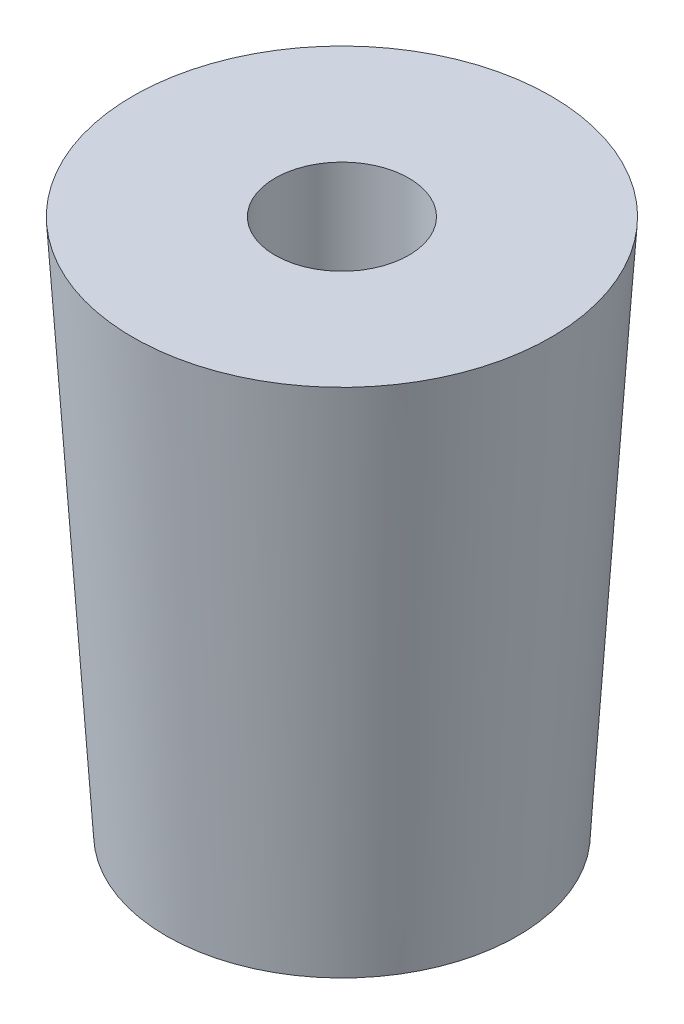
ISO-10303-21;
HEADER;
FILE_DESCRIPTION(('STEP AP214'),'2;1');
FILE_NAME('part.step','',(''),(''),'','','');
FILE_SCHEMA(('AUTOMOTIVE_DESIGN { 1 0 10303 214 1 1 1 1 }'));
ENDSEC;
DATA;
#1=APPLICATION_CONTEXT('core data for automotive mechanical design processes');
#2=APPLICATION_PROTOCOL_DEFINITION('international standard','automotive_design',2000,#1);
#3=PRODUCT_CONTEXT('',#1,'mechanical');
#4=PRODUCT('Part','Part','',(#3));
#5=PRODUCT_RELATED_PRODUCT_CATEGORY('part','',(#4));
#6=PRODUCT_DEFINITION_FORMATION('','',#4);
#7=PRODUCT_DEFINITION_CONTEXT('part definition',#1,'design');
#8=PRODUCT_DEFINITION('design','',#6,#7);
#9=PRODUCT_DEFINITION_SHAPE('','',#8);
#10=(LENGTH_UNIT() NAMED_UNIT(*) SI_UNIT(.MILLI.,.METRE.));
#11=(NAMED_UNIT(*) PLANE_ANGLE_UNIT() SI_UNIT($,.RADIAN.));
#12=(NAMED_UNIT(*) SI_UNIT($,.STERADIAN.) SOLID_ANGLE_UNIT());
#13=UNCERTAINTY_MEASURE_WITH_UNIT(LENGTH_MEASURE(1.E-05),#10,'distance_accuracy_value','');
#14=(GEOMETRIC_REPRESENTATION_CONTEXT(3) GLOBAL_UNCERTAINTY_ASSIGNED_CONTEXT((#13)) GLOBAL_UNIT_ASSIGNED_CONTEXT((#10,
#11,#12)) REPRESENTATION_CONTEXT('',''));
#15=CARTESIAN_POINT('',(0.,0.,0.));
#16=DIRECTION('',(0.,0.,1.));
#17=DIRECTION('',(1.,0.,0.));
#18=AXIS2_PLACEMENT_3D('',#15,#16,#17);
#19=CARTESIAN_POINT('',(0.,0.,0.));
#20=DIRECTION('',(0.,-1.,0.));
#21=DIRECTION('',(0.,0.,-1.));
#22=AXIS2_PLACEMENT_3D('',#19,#20,#21);
#23=PLANE('',#22);
#24=CARTESIAN_POINT('',(0.,0.,0.));
#25=DIRECTION('',(0.,1.,0.));
#26=DIRECTION('',(0.,0.,1.));
#27=AXIS2_PLACEMENT_3D('',#24,#25,#26);
#28=CIRCLE('',#27,3.175);
#29=CARTESIAN_POINT('',(0.,0.,3.175));
#30=VERTEX_POINT('',#29);
#31=EDGE_CURVE('E41',#30,#30,#28,.T.);
#32=ORIENTED_EDGE('',*,*,#31,.T.);
#33=EDGE_LOOP('',(#32));
#34=FACE_BOUND('',#33,.T.);
#35=CARTESIAN_POINT('',(0.,0.,0.));
#36=DIRECTION('',(0.,-1.,0.));
#37=DIRECTION('',(0.,0.,-1.));
#38=AXIS2_PLACEMENT_3D('',#35,#36,#37);
#39=CIRCLE('',#38,8.334375);
#40=CARTESIAN_POINT('',(0.,0.,-8.334375));
#41=VERTEX_POINT('',#40);
#42=EDGE_CURVE('E10',#41,#41,#39,.T.);
#43=ORIENTED_EDGE('',*,*,#42,.T.);
#44=EDGE_LOOP('',(#43));
#45=FACE_BOUND('',#44,.T.);
#46=ADVANCED_FACE('F31',(#34,#45),#23,.T.);
#47=CARTESIAN_POINT('',(0.,0.,0.));
#48=DIRECTION('',(0.,1.,0.));
#49=DIRECTION('',(0.,0.,1.));
#50=AXIS2_PLACEMENT_3D('',#47,#48,#49);
#51=CONICAL_SURFACE('',#50,8.334375,0.0624188099959574);
#52=CARTESIAN_POINT('',(0.,25.4,0.));
#53=DIRECTION('',(0.,-1.,0.));
#54=DIRECTION('',(0.,0.,-1.));
#55=AXIS2_PLACEMENT_3D('',#52,#53,#54);
#56=CIRCLE('',#55,9.921875);
#57=CARTESIAN_POINT('',(0.,25.4,-9.921875));
#58=VERTEX_POINT('',#57);
#59=EDGE_CURVE('E37',#58,#58,#56,.T.);
#60=ORIENTED_EDGE('',*,*,#59,.T.);
#61=EDGE_LOOP('',(#60));
#62=FACE_BOUND('',#61,.T.);
#63=ORIENTED_EDGE('',*,*,#42,.F.);
#64=EDGE_LOOP('',(#63));
#65=FACE_BOUND('',#64,.T.);
#66=ADVANCED_FACE('F56',(#62,#65),#51,.T.);
#67=CARTESIAN_POINT('',(0.,25.4,-9.921875));
#68=DIRECTION('',(0.,1.,0.));
#69=DIRECTION('',(0.,0.,1.));
#70=AXIS2_PLACEMENT_3D('',#67,#68,#69);
#71=PLANE('',#70);
#72=CARTESIAN_POINT('',(0.,25.4,0.));
#73=DIRECTION('',(0.,1.,0.));
#74=DIRECTION('',(0.,0.,1.));
#75=AXIS2_PLACEMENT_3D('',#72,#73,#74);
#76=CIRCLE('',#75,3.175);
#77=CARTESIAN_POINT('',(0.,25.4,3.175));
#78=VERTEX_POINT('',#77);
#79=EDGE_CURVE('E45',#78,#78,#76,.T.);
#80=ORIENTED_EDGE('',*,*,#79,.F.);
#81=EDGE_LOOP('',(#80));
#82=FACE_BOUND('',#81,.T.);
#83=ORIENTED_EDGE('',*,*,#59,.F.);
#84=EDGE_LOOP('',(#83));
#85=FACE_BOUND('',#84,.T.);
#86=ADVANCED_FACE('F53',(#82,#85),#71,.T.);
#87=CARTESIAN_POINT('',(0.,0.,0.));
#88=DIRECTION('',(0.,1.,0.));
#89=DIRECTION('',(0.,0.,1.));
#90=AXIS2_PLACEMENT_3D('',#87,#88,#89);
#91=CYLINDRICAL_SURFACE('',#90,3.175);
#92=ORIENTED_EDGE('',*,*,#31,.F.);
#93=EDGE_LOOP('',(#92));
#94=FACE_BOUND('',#93,.T.);
#95=ORIENTED_EDGE('',*,*,#79,.T.);
#96=EDGE_LOOP('',(#95));
#97=FACE_BOUND('',#96,.T.);
#98=ADVANCED_FACE('F51',(#94,#97),#91,.F.);
#99=CLOSED_SHELL('',(#46,#66,#86,#98));
#100=MANIFOLD_SOLID_BREP('B2',#99);
#101=ADVANCED_BREP_SHAPE_REPRESENTATION('',(#18,#100),#14);
#102=SHAPE_DEFINITION_REPRESENTATION(#9,#101);
ENDSEC;
END-ISO-10303-21;
